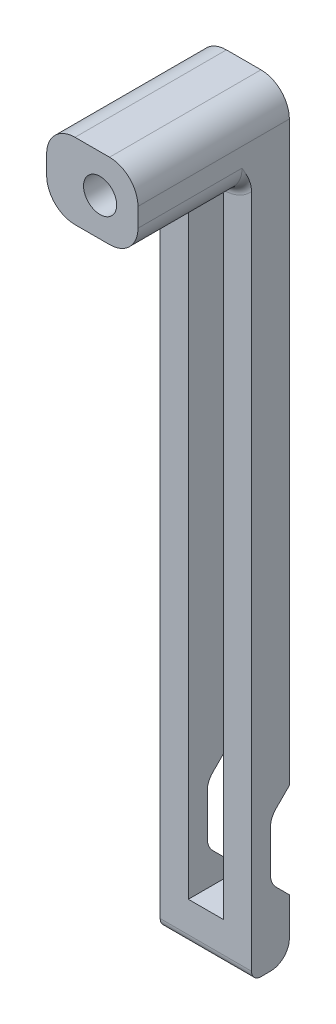
ISO-10303-21;
HEADER;
FILE_DESCRIPTION(('STEP AP214'),'2;1');
FILE_NAME('part.step','',(''),(''),'','','');
FILE_SCHEMA(('AUTOMOTIVE_DESIGN { 1 0 10303 214 1 1 1 1 }'));
ENDSEC;
DATA;
#1=APPLICATION_CONTEXT('core data for automotive mechanical design processes');
#2=APPLICATION_PROTOCOL_DEFINITION('international standard','automotive_design',2000,#1);
#3=PRODUCT_CONTEXT('',#1,'mechanical');
#4=PRODUCT('Part','Part','',(#3));
#5=PRODUCT_RELATED_PRODUCT_CATEGORY('part','',(#4));
#6=PRODUCT_DEFINITION_FORMATION('','',#4);
#7=PRODUCT_DEFINITION_CONTEXT('part definition',#1,'design');
#8=PRODUCT_DEFINITION('design','',#6,#7);
#9=PRODUCT_DEFINITION_SHAPE('','',#8);
#10=(LENGTH_UNIT() NAMED_UNIT(*) SI_UNIT(.MILLI.,.METRE.));
#11=(NAMED_UNIT(*) PLANE_ANGLE_UNIT() SI_UNIT($,.RADIAN.));
#12=(NAMED_UNIT(*) SI_UNIT($,.STERADIAN.) SOLID_ANGLE_UNIT());
#13=UNCERTAINTY_MEASURE_WITH_UNIT(LENGTH_MEASURE(1.E-05),#10,'distance_accuracy_value','');
#14=(GEOMETRIC_REPRESENTATION_CONTEXT(3) GLOBAL_UNCERTAINTY_ASSIGNED_CONTEXT((#13)) GLOBAL_UNIT_ASSIGNED_CONTEXT((#10,
#11,#12)) REPRESENTATION_CONTEXT('',''));
#15=CARTESIAN_POINT('',(0.,0.,0.));
#16=DIRECTION('',(0.,0.,1.));
#17=DIRECTION('',(1.,0.,0.));
#18=AXIS2_PLACEMENT_3D('',#15,#16,#17);
#19=CARTESIAN_POINT('',(0.,0.,2.));
#20=DIRECTION('',(0.,0.,1.));
#21=DIRECTION('',(1.,0.,0.));
#22=AXIS2_PLACEMENT_3D('',#19,#20,#21);
#23=PLANE('',#22);
#24=DIRECTION('',(0.,1.,0.));
#25=VECTOR('',#24,1.);
#26=CARTESIAN_POINT('',(1.85,30.75,2.));
#27=LINE('',#26,#25);
#28=CARTESIAN_POINT('',(1.85000000000001,-35.75,2.));
#29=VERTEX_POINT('',#28);
#30=CARTESIAN_POINT('',(1.85,30.75,2.));
#31=VERTEX_POINT('',#30);
#32=EDGE_CURVE('E508',#29,#31,#27,.T.);
#33=ORIENTED_EDGE('',*,*,#32,.F.);
#34=DIRECTION('',(1.,0.,0.));
#35=VECTOR('',#34,1.);
#36=CARTESIAN_POINT('',(-1.84999999999999,-35.75,2.));
#37=LINE('',#36,#35);
#38=CARTESIAN_POINT('',(-1.84999999999999,-35.75,2.));
#39=VERTEX_POINT('',#38);
#40=EDGE_CURVE('E528',#39,#29,#37,.T.);
#41=ORIENTED_EDGE('',*,*,#40,.F.);
#42=DIRECTION('',(0.,-1.,0.));
#43=VECTOR('',#42,1.);
#44=CARTESIAN_POINT('',(-1.85,30.75,2.));
#45=LINE('',#44,#43);
#46=CARTESIAN_POINT('',(-1.85,30.75,2.));
#47=VERTEX_POINT('',#46);
#48=EDGE_CURVE('E525',#47,#39,#45,.T.);
#49=ORIENTED_EDGE('',*,*,#48,.F.);
#50=DIRECTION('',(-1.,0.,0.));
#51=VECTOR('',#50,1.);
#52=CARTESIAN_POINT('',(-1.85,30.75,2.));
#53=LINE('',#52,#51);
#54=EDGE_CURVE('E522',#31,#47,#53,.T.);
#55=ORIENTED_EDGE('',*,*,#54,.F.);
#56=EDGE_LOOP('',(#33,#41,#49,#55));
#57=FACE_BOUND('',#56,.T.);
#58=DIRECTION('',(1.,0.,0.));
#59=VECTOR('',#58,1.);
#60=CARTESIAN_POINT('',(0.,31.,2.));
#61=LINE('',#60,#59);
#62=CARTESIAN_POINT('',(1.825,31.,2.));
#63=VERTEX_POINT('',#62);
#64=CARTESIAN_POINT('',(-1.825,31.,2.));
#65=VERTEX_POINT('',#64);
#66=EDGE_CURVE('E410',#63,#65,#61,.F.);
#67=ORIENTED_EDGE('',*,*,#66,.T.);
#68=CARTESIAN_POINT('',(-1.825,35.,2.));
#69=DIRECTION('',(0.,0.,1.));
#70=DIRECTION('',(1.,0.,0.));
#71=AXIS2_PLACEMENT_3D('',#68,#69,#70);
#72=CIRCLE('',#71,4.);
#73=CARTESIAN_POINT('',(-4.825,32.3542486889354,2.));
#74=VERTEX_POINT('',#73);
#75=EDGE_CURVE('E414',#65,#74,#72,.F.);
#76=ORIENTED_EDGE('',*,*,#75,.T.);
#77=DIRECTION('',(0.,-1.,0.));
#78=VECTOR('',#77,1.);
#79=CARTESIAN_POINT('',(-4.825,40.,2.));
#80=LINE('',#79,#78);
#81=CARTESIAN_POINT('',(-4.82499999999999,-39.,2.));
#82=VERTEX_POINT('',#81);
#83=EDGE_CURVE('E285',#74,#82,#80,.T.);
#84=ORIENTED_EDGE('',*,*,#83,.T.);
#85=DIRECTION('',(1.,0.,0.));
#86=VECTOR('',#85,1.);
#87=CARTESIAN_POINT('',(4.82500000000001,-39.,2.));
#88=LINE('',#87,#86);
#89=CARTESIAN_POINT('',(4.82500000000001,-39.,2.));
#90=VERTEX_POINT('',#89);
#91=EDGE_CURVE('E343',#82,#90,#88,.T.);
#92=ORIENTED_EDGE('',*,*,#91,.T.);
#93=DIRECTION('',(0.,1.,0.));
#94=VECTOR('',#93,1.);
#95=CARTESIAN_POINT('',(4.825,40.,2.));
#96=LINE('',#95,#94);
#97=CARTESIAN_POINT('',(4.825,32.3542486889354,2.));
#98=VERTEX_POINT('',#97);
#99=EDGE_CURVE('E292',#90,#98,#96,.T.);
#100=ORIENTED_EDGE('',*,*,#99,.T.);
#101=CARTESIAN_POINT('',(1.825,35.,2.));
#102=DIRECTION('',(0.,0.,1.));
#103=DIRECTION('',(1.,0.,0.));
#104=AXIS2_PLACEMENT_3D('',#101,#102,#103);
#105=CIRCLE('',#104,4.);
#106=EDGE_CURVE('E412',#98,#63,#105,.F.);
#107=ORIENTED_EDGE('',*,*,#106,.T.);
#108=EDGE_LOOP('',(#67,#76,#84,#92,#100,#107));
#109=FACE_BOUND('',#108,.T.);
#110=ADVANCED_FACE('F37',(#57,#109),#23,.T.);
#111=CARTESIAN_POINT('',(0.,0.,-2.));
#112=DIRECTION('',(0.,0.,1.));
#113=DIRECTION('',(1.,0.,0.));
#114=AXIS2_PLACEMENT_3D('',#111,#112,#113);
#115=PLANE('',#114);
#116=DIRECTION('',(0.,1.,0.));
#117=VECTOR('',#116,1.);
#118=CARTESIAN_POINT('',(4.825,40.,-2.));
#119=LINE('',#118,#117);
#120=CARTESIAN_POINT('',(4.82500000000001,-38.,-2.));
#121=VERTEX_POINT('',#120);
#122=CARTESIAN_POINT('',(4.82500000000001,-34.,-2.));
#123=VERTEX_POINT('',#122);
#124=EDGE_CURVE('E277',#121,#123,#119,.T.);
#125=ORIENTED_EDGE('',*,*,#124,.F.);
#126=DIRECTION('',(1.,0.,0.));
#127=VECTOR('',#126,1.);
#128=CARTESIAN_POINT('',(0.,-38.,-2.));
#129=LINE('',#128,#127);
#130=CARTESIAN_POINT('',(-4.82499999999999,-38.,-2.));
#131=VERTEX_POINT('',#130);
#132=EDGE_CURVE('E377',#121,#131,#129,.F.);
#133=ORIENTED_EDGE('',*,*,#132,.T.);
#134=DIRECTION('',(0.,-1.,0.));
#135=VECTOR('',#134,1.);
#136=CARTESIAN_POINT('',(-4.825,40.,-2.));
#137=LINE('',#136,#135);
#138=CARTESIAN_POINT('',(-4.82499999999999,-34.4142135623731,-2.));
#139=VERTEX_POINT('',#138);
#140=EDGE_CURVE('E289',#139,#131,#137,.T.);
#141=ORIENTED_EDGE('',*,*,#140,.F.);
#142=DIRECTION('',(1.,0.,0.));
#143=VECTOR('',#142,1.);
#144=CARTESIAN_POINT('',(0.,-34.4142135623731,-2.));
#145=LINE('',#144,#143);
#146=CARTESIAN_POINT('',(-1.84999999999999,-34.4142135623731,-2.));
#147=VERTEX_POINT('',#146);
#148=EDGE_CURVE('E353',#139,#147,#145,.T.);
#149=ORIENTED_EDGE('',*,*,#148,.T.);
#150=DIRECTION('',(0.,-1.,0.));
#151=VECTOR('',#150,1.);
#152=CARTESIAN_POINT('',(-1.85,30.75,-2.));
#153=LINE('',#152,#151);
#154=CARTESIAN_POINT('',(-1.84999999999999,-35.75,-2.));
#155=VERTEX_POINT('',#154);
#156=EDGE_CURVE('E514',#147,#155,#153,.T.);
#157=ORIENTED_EDGE('',*,*,#156,.T.);
#158=DIRECTION('',(1.,0.,0.));
#159=VECTOR('',#158,1.);
#160=CARTESIAN_POINT('',(-1.84999999999999,-35.75,-2.));
#161=LINE('',#160,#159);
#162=CARTESIAN_POINT('',(1.85000000000001,-35.75,-2.));
#163=VERTEX_POINT('',#162);
#164=EDGE_CURVE('E518',#155,#163,#161,.T.);
#165=ORIENTED_EDGE('',*,*,#164,.T.);
#166=DIRECTION('',(0.,1.,0.));
#167=VECTOR('',#166,1.);
#168=CARTESIAN_POINT('',(1.85,30.75,-2.));
#169=LINE('',#168,#167);
#170=CARTESIAN_POINT('',(1.85000000000001,-34.,-2.));
#171=VERTEX_POINT('',#170);
#172=EDGE_CURVE('E494',#163,#171,#169,.T.);
#173=ORIENTED_EDGE('',*,*,#172,.T.);
#174=DIRECTION('',(1.,0.,0.));
#175=VECTOR('',#174,1.);
#176=CARTESIAN_POINT('',(-4.825,-34.,-2.));
#177=LINE('',#176,#175);
#178=EDGE_CURVE('E260',#171,#123,#177,.T.);
#179=ORIENTED_EDGE('',*,*,#178,.T.);
#180=EDGE_LOOP('',(#125,#133,#141,#149,#157,#165,#173,#179));
#181=FACE_BOUND('',#180,.T.);
#182=ADVANCED_FACE('F450',(#181),#115,.F.);
#183=CARTESIAN_POINT('',(4.825,40.,2.));
#184=DIRECTION('',(-1.,0.,0.));
#185=DIRECTION('',(0.,-1.,0.));
#186=AXIS2_PLACEMENT_3D('',#183,#184,#185);
#187=PLANE('',#186);
#188=CARTESIAN_POINT('',(4.82500000000001,-24.,-2.));
#189=VERTEX_POINT('',#188);
#190=CARTESIAN_POINT('',(4.825,37.,-2.));
#191=VERTEX_POINT('',#190);
#192=EDGE_CURVE('E266',#189,#191,#119,.T.);
#193=ORIENTED_EDGE('',*,*,#192,.T.);
#194=DIRECTION('',(0.,0.,-1.));
#195=VECTOR('',#194,1.);
#196=CARTESIAN_POINT('',(4.825,37.,2.));
#197=LINE('',#196,#195);
#198=CARTESIAN_POINT('',(4.825,37.,14.));
#199=VERTEX_POINT('',#198);
#200=EDGE_CURVE('E404',#191,#199,#197,.F.);
#201=ORIENTED_EDGE('',*,*,#200,.T.);
#202=DIRECTION('',(0.,1.,0.));
#203=VECTOR('',#202,1.);
#204=CARTESIAN_POINT('',(4.825,32.,14.));
#205=LINE('',#204,#203);
#206=CARTESIAN_POINT('',(4.825,35.,14.));
#207=VERTEX_POINT('',#206);
#208=EDGE_CURVE('E567',#207,#199,#205,.T.);
#209=ORIENTED_EDGE('',*,*,#208,.F.);
#210=DIRECTION('',(0.,0.,-1.));
#211=VECTOR('',#210,1.);
#212=CARTESIAN_POINT('',(4.825,35.,2.));
#213=LINE('',#212,#211);
#214=CARTESIAN_POINT('',(4.825,35.,3.));
#215=VERTEX_POINT('',#214);
#216=EDGE_CURVE('E402',#207,#215,#213,.T.);
#217=ORIENTED_EDGE('',*,*,#216,.T.);
#218=CARTESIAN_POINT('',(4.825,32.3542486889354,2.));
#219=CARTESIAN_POINT('',(4.825,32.4298380551689,2.00001943055381));
#220=CARTESIAN_POINT('',(4.825,32.5053247598366,2.00374525929694));
#221=CARTESIAN_POINT('',(4.825,32.6555519131941,2.01764872031717));
#222=CARTESIAN_POINT('',(4.825,32.7302936123834,2.0278125407329));
#223=CARTESIAN_POINT('',(4.825,32.9509200380866,2.06617731698388));
#224=CARTESIAN_POINT('',(4.825,33.095419127168,2.10230955711424));
#225=CARTESIAN_POINT('',(4.825,33.3922579658776,2.19397177417643));
#226=CARTESIAN_POINT('',(4.825,33.5441230208571,2.2509618691382));
#227=CARTESIAN_POINT('',(4.825,33.8426105747907,2.37746006612358));
#228=CARTESIAN_POINT('',(4.825,33.9892268347202,2.44698250896105));
#229=CARTESIAN_POINT('',(4.825,34.4249203999017,2.66804637884328));
#230=CARTESIAN_POINT('',(4.825,34.7078523703817,2.83132923919401));
#231=CARTESIAN_POINT('',(4.825,34.993675467035,2.99634854847155));
#232=CARTESIAN_POINT('',(4.825,34.9968377449664,2.99817429080111));
#233=CARTESIAN_POINT('',(4.825,35.,3.));
#234=B_SPLINE_CURVE_WITH_KNOTS('',3,(#218,#219,#220,#221,#222,#223,#224,#225,#226,#227,#228,
#229,#230,#231,#232,#233),.UNSPECIFIED.,.F.,.F.,(4,2,2,2,2,2,2,4),(0.,0.226523097183508,
0.452561857357312,0.898071970071575,1.3839199780656,1.87032751436397,2.84948260162625,
2.86043705277646),.UNSPECIFIED.);
#235=EDGE_CURVE('E11',#215,#98,#234,.F.);
#236=ORIENTED_EDGE('',*,*,#235,.T.);
#237=ORIENTED_EDGE('',*,*,#99,.F.);
#238=CARTESIAN_POINT('',(4.82500000000001,-39.,1.));
#239=DIRECTION('',(-1.,0.,0.));
#240=DIRECTION('',(0.,-1.,0.));
#241=AXIS2_PLACEMENT_3D('',#238,#239,#240);
#242=CIRCLE('',#241,1.);
#243=CARTESIAN_POINT('',(4.82500000000001,-40.,1.));
#244=VERTEX_POINT('',#243);
#245=EDGE_CURVE('E346',#90,#244,#242,.F.);
#246=ORIENTED_EDGE('',*,*,#245,.T.);
#247=DIRECTION('',(0.,0.,-1.));
#248=VECTOR('',#247,1.);
#249=CARTESIAN_POINT('',(4.82500000000001,-40.,2.));
#250=LINE('',#249,#248);
#251=CARTESIAN_POINT('',(4.82500000000001,-40.,0.));
#252=VERTEX_POINT('',#251);
#253=EDGE_CURVE('E293',#244,#252,#250,.T.);
#254=ORIENTED_EDGE('',*,*,#253,.T.);
#255=CARTESIAN_POINT('',(4.82500000000001,-38.,0.));
#256=DIRECTION('',(-1.,0.,0.));
#257=DIRECTION('',(0.,-1.,0.));
#258=AXIS2_PLACEMENT_3D('',#255,#256,#257);
#259=CIRCLE('',#258,2.);
#260=EDGE_CURVE('E375',#252,#121,#259,.F.);
#261=ORIENTED_EDGE('',*,*,#260,.T.);
#262=ORIENTED_EDGE('',*,*,#124,.T.);
#263=DIRECTION('',(0.,-0.70710678118655,-0.707106781186545));
#264=VECTOR('',#263,1.);
#265=CARTESIAN_POINT('',(4.82500000000001,-32.,0.));
#266=LINE('',#265,#264);
#267=CARTESIAN_POINT('',(4.82500000000001,-32.5857864376269,-0.585786437626901));
#268=VERTEX_POINT('',#267);
#269=EDGE_CURVE('E501',#268,#123,#266,.T.);
#270=ORIENTED_EDGE('',*,*,#269,.F.);
#271=CARTESIAN_POINT('',(4.82500000000001,-31.1715728752538,-2.));
#272=DIRECTION('',(-1.,0.,0.));
#273=DIRECTION('',(0.,-1.,0.));
#274=AXIS2_PLACEMENT_3D('',#271,#272,#273);
#275=CIRCLE('',#274,2.);
#276=CARTESIAN_POINT('',(4.82500000000001,-31.1715728752538,0.));
#277=VERTEX_POINT('',#276);
#278=EDGE_CURVE('E339',#268,#277,#275,.T.);
#279=ORIENTED_EDGE('',*,*,#278,.T.);
#280=DIRECTION('',(0.,-1.,0.));
#281=VECTOR('',#280,1.);
#282=CARTESIAN_POINT('',(4.82500000000001,-26.,0.));
#283=LINE('',#282,#281);
#284=CARTESIAN_POINT('',(4.82500000000001,-26.8284271247462,0.));
#285=VERTEX_POINT('',#284);
#286=EDGE_CURVE('E270',#285,#277,#283,.T.);
#287=ORIENTED_EDGE('',*,*,#286,.F.);
#288=CARTESIAN_POINT('',(4.82500000000001,-26.8284271247462,-2.));
#289=DIRECTION('',(-1.,0.,0.));
#290=DIRECTION('',(0.,-1.,0.));
#291=AXIS2_PLACEMENT_3D('',#288,#289,#290);
#292=CIRCLE('',#291,2.);
#293=CARTESIAN_POINT('',(4.82500000000001,-25.4142135623731,-0.585786437626897));
#294=VERTEX_POINT('',#293);
#295=EDGE_CURVE('E269',#285,#294,#292,.T.);
#296=ORIENTED_EDGE('',*,*,#295,.T.);
#297=DIRECTION('',(0.,-0.707106781186551,0.707106781186544));
#298=VECTOR('',#297,1.);
#299=CARTESIAN_POINT('',(4.82500000000001,-24.,-2.));
#300=LINE('',#299,#298);
#301=EDGE_CURVE('E253',#189,#294,#300,.T.);
#302=ORIENTED_EDGE('',*,*,#301,.F.);
#303=EDGE_LOOP('',(#193,#201,#209,#217,#236,#237,#246,#254,#261,#262,#270,#279,#287,#296,#302));
#304=FACE_BOUND('',#303,.T.);
#305=ADVANCED_FACE('F265',(#304),#187,.F.);
#306=CARTESIAN_POINT('',(-4.825,40.,2.));
#307=DIRECTION('',(0.,-1.,0.));
#308=DIRECTION('',(0.,0.,-1.));
#309=AXIS2_PLACEMENT_3D('',#306,#307,#308);
#310=PLANE('',#309);
#311=DIRECTION('',(-1.,0.,0.));
#312=VECTOR('',#311,1.);
#313=CARTESIAN_POINT('',(-4.825,40.,-2.));
#314=LINE('',#313,#312);
#315=CARTESIAN_POINT('',(1.825,40.,-2.));
#316=VERTEX_POINT('',#315);
#317=CARTESIAN_POINT('',(-1.825,40.,-2.));
#318=VERTEX_POINT('',#317);
#319=EDGE_CURVE('E280',#316,#318,#314,.T.);
#320=ORIENTED_EDGE('',*,*,#319,.T.);
#321=DIRECTION('',(0.,0.,-1.));
#322=VECTOR('',#321,1.);
#323=CARTESIAN_POINT('',(-1.825,40.,2.));
#324=LINE('',#323,#322);
#325=CARTESIAN_POINT('',(-1.825,40.,14.));
#326=VERTEX_POINT('',#325);
#327=EDGE_CURVE('E392',#318,#326,#324,.F.);
#328=ORIENTED_EDGE('',*,*,#327,.T.);
#329=DIRECTION('',(-1.,0.,0.));
#330=VECTOR('',#329,1.);
#331=CARTESIAN_POINT('',(-4.825,40.,14.));
#332=LINE('',#331,#330);
#333=CARTESIAN_POINT('',(1.825,40.,14.));
#334=VERTEX_POINT('',#333);
#335=EDGE_CURVE('E271',#334,#326,#332,.T.);
#336=ORIENTED_EDGE('',*,*,#335,.F.);
#337=DIRECTION('',(0.,0.,-1.));
#338=VECTOR('',#337,1.);
#339=CARTESIAN_POINT('',(1.825,40.,2.));
#340=LINE('',#339,#338);
#341=EDGE_CURVE('E389',#334,#316,#340,.T.);
#342=ORIENTED_EDGE('',*,*,#341,.T.);
#343=EDGE_LOOP('',(#320,#328,#336,#342));
#344=FACE_BOUND('',#343,.T.);
#345=ADVANCED_FACE('F473',(#344),#310,.F.);
#346=CARTESIAN_POINT('',(-4.825,40.,2.));
#347=DIRECTION('',(1.,0.,0.));
#348=DIRECTION('',(0.,1.,0.));
#349=AXIS2_PLACEMENT_3D('',#346,#347,#348);
#350=PLANE('',#349);
#351=DIRECTION('',(0.,-1.,0.));
#352=VECTOR('',#351,1.);
#353=CARTESIAN_POINT('',(-4.825,32.,14.));
#354=LINE('',#353,#352);
#355=CARTESIAN_POINT('',(-4.825,37.,14.));
#356=VERTEX_POINT('',#355);
#357=CARTESIAN_POINT('',(-4.825,35.,14.));
#358=VERTEX_POINT('',#357);
#359=EDGE_CURVE('E565',#356,#358,#354,.T.);
#360=ORIENTED_EDGE('',*,*,#359,.F.);
#361=DIRECTION('',(0.,0.,-1.));
#362=VECTOR('',#361,1.);
#363=CARTESIAN_POINT('',(-4.825,37.,2.));
#364=LINE('',#363,#362);
#365=CARTESIAN_POINT('',(-4.825,37.,-2.));
#366=VERTEX_POINT('',#365);
#367=EDGE_CURVE('E383',#356,#366,#364,.T.);
#368=ORIENTED_EDGE('',*,*,#367,.T.);
#369=CARTESIAN_POINT('',(-4.82499999999999,-23.5857864376269,-2.));
#370=VERTEX_POINT('',#369);
#371=EDGE_CURVE('E290',#366,#370,#137,.T.);
#372=ORIENTED_EDGE('',*,*,#371,.T.);
#373=CARTESIAN_POINT('',(-4.82499999999999,-23.5857864376269,-1.));
#374=DIRECTION('',(1.,0.,0.));
#375=DIRECTION('',(0.,1.,0.));
#376=AXIS2_PLACEMENT_3D('',#373,#374,#375);
#377=CIRCLE('',#376,1.);
#378=CARTESIAN_POINT('',(-4.82500000000001,-24.2928932188134,-1.70710678118655));
#379=VERTEX_POINT('',#378);
#380=EDGE_CURVE('E362',#370,#379,#377,.F.);
#381=ORIENTED_EDGE('',*,*,#380,.T.);
#382=DIRECTION('',(0.,-0.707106781186551,0.707106781186544));
#383=VECTOR('',#382,1.);
#384=CARTESIAN_POINT('',(-4.82500000000001,-24.,-2.));
#385=LINE('',#384,#383);
#386=CARTESIAN_POINT('',(-4.82500000000001,-25.4142135623731,-0.585786437626897));
#387=VERTEX_POINT('',#386);
#388=EDGE_CURVE('E576',#379,#387,#385,.T.);
#389=ORIENTED_EDGE('',*,*,#388,.T.);
#390=CARTESIAN_POINT('',(-4.82499999999999,-26.8284271247462,-2.));
#391=DIRECTION('',(1.,0.,0.));
#392=DIRECTION('',(0.,1.,0.));
#393=AXIS2_PLACEMENT_3D('',#390,#391,#392);
#394=CIRCLE('',#393,2.);
#395=CARTESIAN_POINT('',(-4.82500000000001,-26.8284271247462,0.));
#396=VERTEX_POINT('',#395);
#397=EDGE_CURVE('E334',#387,#396,#394,.T.);
#398=ORIENTED_EDGE('',*,*,#397,.T.);
#399=DIRECTION('',(0.,-1.,0.));
#400=VECTOR('',#399,1.);
#401=CARTESIAN_POINT('',(-4.82500000000001,-26.,0.));
#402=LINE('',#401,#400);
#403=CARTESIAN_POINT('',(-4.825,-31.1715728752538,0.));
#404=VERTEX_POINT('',#403);
#405=EDGE_CURVE('E578',#396,#404,#402,.T.);
#406=ORIENTED_EDGE('',*,*,#405,.T.);
#407=CARTESIAN_POINT('',(-4.82499999999999,-31.1715728752538,-2.));
#408=DIRECTION('',(1.,0.,0.));
#409=DIRECTION('',(0.,1.,0.));
#410=AXIS2_PLACEMENT_3D('',#407,#408,#409);
#411=CIRCLE('',#410,2.);
#412=CARTESIAN_POINT('',(-4.825,-32.5857864376269,-0.585786437626901));
#413=VERTEX_POINT('',#412);
#414=EDGE_CURVE('E330',#404,#413,#411,.T.);
#415=ORIENTED_EDGE('',*,*,#414,.T.);
#416=DIRECTION('',(0.,-0.70710678118655,-0.707106781186545));
#417=VECTOR('',#416,1.);
#418=CARTESIAN_POINT('',(-4.825,-32.,0.));
#419=LINE('',#418,#417);
#420=CARTESIAN_POINT('',(-4.825,-33.7071067811866,-1.70710678118655));
#421=VERTEX_POINT('',#420);
#422=EDGE_CURVE('E261',#413,#421,#419,.T.);
#423=ORIENTED_EDGE('',*,*,#422,.T.);
#424=CARTESIAN_POINT('',(-4.82499999999999,-34.4142135623731,-1.));
#425=DIRECTION('',(1.,0.,0.));
#426=DIRECTION('',(0.,1.,0.));
#427=AXIS2_PLACEMENT_3D('',#424,#425,#426);
#428=CIRCLE('',#427,1.);
#429=EDGE_CURVE('E364',#421,#139,#428,.F.);
#430=ORIENTED_EDGE('',*,*,#429,.T.);
#431=ORIENTED_EDGE('',*,*,#140,.T.);
#432=CARTESIAN_POINT('',(-4.82499999999999,-38.,0.));
#433=DIRECTION('',(1.,0.,0.));
#434=DIRECTION('',(0.,1.,0.));
#435=AXIS2_PLACEMENT_3D('',#432,#433,#434);
#436=CIRCLE('',#435,2.);
#437=CARTESIAN_POINT('',(-4.82499999999999,-40.,0.));
#438=VERTEX_POINT('',#437);
#439=EDGE_CURVE('E379',#131,#438,#436,.F.);
#440=ORIENTED_EDGE('',*,*,#439,.T.);
#441=DIRECTION('',(0.,0.,-1.));
#442=VECTOR('',#441,1.);
#443=CARTESIAN_POINT('',(-4.82499999999999,-40.,2.));
#444=LINE('',#443,#442);
#445=CARTESIAN_POINT('',(-4.82499999999999,-40.,1.));
#446=VERTEX_POINT('',#445);
#447=EDGE_CURVE('E296',#446,#438,#444,.T.);
#448=ORIENTED_EDGE('',*,*,#447,.F.);
#449=CARTESIAN_POINT('',(-4.82499999999999,-39.,1.));
#450=DIRECTION('',(1.,0.,0.));
#451=DIRECTION('',(0.,1.,0.));
#452=AXIS2_PLACEMENT_3D('',#449,#450,#451);
#453=CIRCLE('',#452,1.);
#454=EDGE_CURVE('E350',#446,#82,#453,.F.);
#455=ORIENTED_EDGE('',*,*,#454,.T.);
#456=ORIENTED_EDGE('',*,*,#83,.F.);
#457=CARTESIAN_POINT('',(-4.825,32.3542486889354,2.));
#458=CARTESIAN_POINT('',(-4.825,32.4298380551689,2.00001943055381));
#459=CARTESIAN_POINT('',(-4.825,32.5053247598366,2.00374525929694));
#460=CARTESIAN_POINT('',(-4.825,32.6555519131941,2.01764872031717));
#461=CARTESIAN_POINT('',(-4.825,32.7302936123833,2.0278125407329));
#462=CARTESIAN_POINT('',(-4.825,32.9509200380866,2.06617731698387));
#463=CARTESIAN_POINT('',(-4.825,33.0954191271679,2.10230955711424));
#464=CARTESIAN_POINT('',(-4.825,33.3922579658776,2.19397177417643));
#465=CARTESIAN_POINT('',(-4.825,33.5441230208571,2.25096186913819));
#466=CARTESIAN_POINT('',(-4.825,33.8426105747907,2.3774600661236));
#467=CARTESIAN_POINT('',(-4.825,33.9892268347202,2.44698250896111));
#468=CARTESIAN_POINT('',(-4.825,34.4249203999018,2.66804637884322));
#469=CARTESIAN_POINT('',(-4.825,34.7078523703819,2.8313292391936));
#470=CARTESIAN_POINT('',(-4.825,34.993675467035,2.99634854847155));
#471=CARTESIAN_POINT('',(-4.825,34.9968377449664,2.99817429080111));
#472=CARTESIAN_POINT('',(-4.825,35.,3.));
#473=B_SPLINE_CURVE_WITH_KNOTS('',3,(#457,#458,#459,#460,#461,#462,#463,#464,#465,#466,#467,
#468,#469,#470,#471,#472),.UNSPECIFIED.,.F.,.F.,(4,2,2,2,2,2,2,4),(0.,0.226523097183481,
0.452561857357263,0.898071970071582,1.38391997806561,1.87032751436402,2.84948260162628,
2.86043705277646),.UNSPECIFIED.);
#474=CARTESIAN_POINT('',(-4.825,35.,3.));
#475=VERTEX_POINT('',#474);
#476=EDGE_CURVE('E47',#74,#475,#473,.T.);
#477=ORIENTED_EDGE('',*,*,#476,.T.);
#478=DIRECTION('',(0.,0.,-1.));
#479=VECTOR('',#478,1.);
#480=CARTESIAN_POINT('',(-4.825,35.,2.));
#481=LINE('',#480,#479);
#482=EDGE_CURVE('E381',#475,#358,#481,.F.);
#483=ORIENTED_EDGE('',*,*,#482,.T.);
#484=EDGE_LOOP('',(#360,#368,#372,#381,#389,#398,#406,#415,#423,#430,#431,#440,#448,#455,#456,
#477,#483));
#485=FACE_BOUND('',#484,.T.);
#486=ADVANCED_FACE('F430',(#485),#350,.F.);
#487=CARTESIAN_POINT('',(-4.82499999999999,-40.,2.));
#488=DIRECTION('',(0.,1.,0.));
#489=DIRECTION('',(0.,0.,1.));
#490=AXIS2_PLACEMENT_3D('',#487,#488,#489);
#491=PLANE('',#490);
#492=ORIENTED_EDGE('',*,*,#447,.T.);
#493=DIRECTION('',(1.,0.,0.));
#494=VECTOR('',#493,1.);
#495=CARTESIAN_POINT('',(-4.82499999999999,-40.,0.));
#496=LINE('',#495,#494);
#497=EDGE_CURVE('E372',#438,#252,#496,.T.);
#498=ORIENTED_EDGE('',*,*,#497,.T.);
#499=ORIENTED_EDGE('',*,*,#253,.F.);
#500=DIRECTION('',(1.,0.,0.));
#501=VECTOR('',#500,1.);
#502=CARTESIAN_POINT('',(-4.82499999999999,-40.,1.));
#503=LINE('',#502,#501);
#504=EDGE_CURVE('E348',#244,#446,#503,.F.);
#505=ORIENTED_EDGE('',*,*,#504,.T.);
#506=EDGE_LOOP('',(#492,#498,#499,#505));
#507=FACE_BOUND('',#506,.T.);
#508=ADVANCED_FACE('F465',(#507),#491,.F.);
#509=CARTESIAN_POINT('',(0.824999999999997,36.,-2.));
#510=DIRECTION('',(0.,0.,1.));
#511=DIRECTION('',(1.,0.,0.));
#512=AXIS2_PLACEMENT_3D('',#509,#510,#511);
#513=CIRCLE('',#512,1.75);
#514=CARTESIAN_POINT('',(2.575,36.,-2.));
#515=VERTEX_POINT('',#514);
#516=EDGE_CURVE('E571',#515,#515,#513,.T.);
#517=ORIENTED_EDGE('',*,*,#516,.T.);
#518=EDGE_LOOP('',(#517));
#519=FACE_BOUND('',#518,.T.);
#520=ORIENTED_EDGE('',*,*,#371,.F.);
#521=CARTESIAN_POINT('',(-1.825,37.,-2.));
#522=DIRECTION('',(0.,0.,1.));
#523=DIRECTION('',(1.,0.,0.));
#524=AXIS2_PLACEMENT_3D('',#521,#522,#523);
#525=CIRCLE('',#524,3.);
#526=EDGE_CURVE('E387',#366,#318,#525,.F.);
#527=ORIENTED_EDGE('',*,*,#526,.T.);
#528=ORIENTED_EDGE('',*,*,#319,.F.);
#529=CARTESIAN_POINT('',(1.825,37.,-2.));
#530=DIRECTION('',(0.,0.,1.));
#531=DIRECTION('',(1.,0.,0.));
#532=AXIS2_PLACEMENT_3D('',#529,#530,#531);
#533=CIRCLE('',#532,3.);
#534=EDGE_CURVE('E276',#316,#191,#533,.F.);
#535=ORIENTED_EDGE('',*,*,#534,.T.);
#536=ORIENTED_EDGE('',*,*,#192,.F.);
#537=DIRECTION('',(1.,0.,0.));
#538=VECTOR('',#537,1.);
#539=CARTESIAN_POINT('',(-4.82500000000001,-24.,-2.));
#540=LINE('',#539,#538);
#541=CARTESIAN_POINT('',(1.85000000000001,-24.,-2.));
#542=VERTEX_POINT('',#541);
#543=EDGE_CURVE('E250',#542,#189,#540,.T.);
#544=ORIENTED_EDGE('',*,*,#543,.F.);
#545=CARTESIAN_POINT('',(1.85,30.75,-2.));
#546=VERTEX_POINT('',#545);
#547=EDGE_CURVE('E511',#542,#546,#169,.T.);
#548=ORIENTED_EDGE('',*,*,#547,.T.);
#549=DIRECTION('',(-1.,0.,0.));
#550=VECTOR('',#549,1.);
#551=CARTESIAN_POINT('',(-1.85,30.75,-2.));
#552=LINE('',#551,#550);
#553=CARTESIAN_POINT('',(-1.85,30.75,-2.));
#554=VERTEX_POINT('',#553);
#555=EDGE_CURVE('E510',#546,#554,#552,.T.);
#556=ORIENTED_EDGE('',*,*,#555,.T.);
#557=CARTESIAN_POINT('',(-1.84999999999999,-23.5857864376269,-2.));
#558=VERTEX_POINT('',#557);
#559=EDGE_CURVE('E515',#554,#558,#153,.T.);
#560=ORIENTED_EDGE('',*,*,#559,.T.);
#561=DIRECTION('',(1.,0.,0.));
#562=VECTOR('',#561,1.);
#563=CARTESIAN_POINT('',(0.,-23.5857864376269,-2.));
#564=LINE('',#563,#562);
#565=EDGE_CURVE('E369',#558,#370,#564,.F.);
#566=ORIENTED_EDGE('',*,*,#565,.T.);
#567=EDGE_LOOP('',(#520,#527,#528,#535,#536,#544,#548,#556,#560,#566));
#568=FACE_BOUND('',#567,.T.);
#569=ADVANCED_FACE('F274',(#519,#568),#115,.F.);
#570=CARTESIAN_POINT('',(1.85,30.75,-2.));
#571=DIRECTION('',(1.,0.,0.));
#572=DIRECTION('',(0.,1.,0.));
#573=AXIS2_PLACEMENT_3D('',#570,#571,#572);
#574=PLANE('',#573);
#575=DIRECTION('',(0.,-0.707106781186551,0.707106781186544));
#576=VECTOR('',#575,1.);
#577=CARTESIAN_POINT('',(1.85,3.3750000000003,-29.375));
#578=LINE('',#577,#576);
#579=CARTESIAN_POINT('',(1.85000000000001,-25.4142135623731,-0.585786437626887));
#580=VERTEX_POINT('',#579);
#581=EDGE_CURVE('E256',#542,#580,#578,.T.);
#582=ORIENTED_EDGE('',*,*,#581,.T.);
#583=CARTESIAN_POINT('',(1.85000000000001,-26.8284271247462,-2.));
#584=DIRECTION('',(1.,0.,0.));
#585=DIRECTION('',(0.,1.,0.));
#586=AXIS2_PLACEMENT_3D('',#583,#584,#585);
#587=CIRCLE('',#586,2.);
#588=CARTESIAN_POINT('',(1.85000000000001,-26.8284271247462,0.));
#589=VERTEX_POINT('',#588);
#590=EDGE_CURVE('E337',#580,#589,#587,.T.);
#591=ORIENTED_EDGE('',*,*,#590,.T.);
#592=DIRECTION('',(0.,-1.,0.));
#593=VECTOR('',#592,1.);
#594=CARTESIAN_POINT('',(1.85,30.75,0.));
#595=LINE('',#594,#593);
#596=CARTESIAN_POINT('',(1.85000000000001,-31.1715728752538,0.));
#597=VERTEX_POINT('',#596);
#598=EDGE_CURVE('E498',#589,#597,#595,.T.);
#599=ORIENTED_EDGE('',*,*,#598,.T.);
#600=CARTESIAN_POINT('',(1.85000000000001,-31.1715728752538,-2.));
#601=DIRECTION('',(1.,0.,0.));
#602=DIRECTION('',(0.,1.,0.));
#603=AXIS2_PLACEMENT_3D('',#600,#601,#602);
#604=CIRCLE('',#603,2.);
#605=CARTESIAN_POINT('',(1.85000000000001,-32.5857864376269,-0.585786437626908));
#606=VERTEX_POINT('',#605);
#607=EDGE_CURVE('E341',#597,#606,#604,.T.);
#608=ORIENTED_EDGE('',*,*,#607,.T.);
#609=DIRECTION('',(0.,-0.70710678118655,-0.707106781186545));
#610=VECTOR('',#609,1.);
#611=CARTESIAN_POINT('',(1.85,-1.62499999999974,30.375));
#612=LINE('',#611,#610);
#613=EDGE_CURVE('E506',#606,#171,#612,.T.);
#614=ORIENTED_EDGE('',*,*,#613,.T.);
#615=ORIENTED_EDGE('',*,*,#172,.F.);
#616=DIRECTION('',(0.,0.,1.));
#617=VECTOR('',#616,1.);
#618=CARTESIAN_POINT('',(1.85000000000001,-35.75,-2.));
#619=LINE('',#618,#617);
#620=EDGE_CURVE('E278',#163,#29,#619,.T.);
#621=ORIENTED_EDGE('',*,*,#620,.T.);
#622=ORIENTED_EDGE('',*,*,#32,.T.);
#623=DIRECTION('',(0.,0.,1.));
#624=VECTOR('',#623,1.);
#625=CARTESIAN_POINT('',(1.85,30.75,-2.));
#626=LINE('',#625,#624);
#627=EDGE_CURVE('E520',#546,#31,#626,.T.);
#628=ORIENTED_EDGE('',*,*,#627,.F.);
#629=ORIENTED_EDGE('',*,*,#547,.F.);
#630=EDGE_LOOP('',(#582,#591,#599,#608,#614,#615,#621,#622,#628,#629));
#631=FACE_BOUND('',#630,.T.);
#632=ADVANCED_FACE('F462',(#631),#574,.F.);
#633=CARTESIAN_POINT('',(-1.84999999999999,-35.75,-2.));
#634=DIRECTION('',(0.,-1.,0.));
#635=DIRECTION('',(1.,0.,0.));
#636=AXIS2_PLACEMENT_3D('',#633,#634,#635);
#637=PLANE('',#636);
#638=ORIENTED_EDGE('',*,*,#40,.T.);
#639=ORIENTED_EDGE('',*,*,#620,.F.);
#640=ORIENTED_EDGE('',*,*,#164,.F.);
#641=DIRECTION('',(0.,0.,1.));
#642=VECTOR('',#641,1.);
#643=CARTESIAN_POINT('',(-1.84999999999999,-35.75,-2.));
#644=LINE('',#643,#642);
#645=EDGE_CURVE('E281',#155,#39,#644,.T.);
#646=ORIENTED_EDGE('',*,*,#645,.T.);
#647=EDGE_LOOP('',(#638,#639,#640,#646));
#648=FACE_BOUND('',#647,.T.);
#649=ADVANCED_FACE('F679',(#648),#637,.F.);
#650=CARTESIAN_POINT('',(-1.85,30.75,-2.));
#651=DIRECTION('',(-1.,0.,0.));
#652=DIRECTION('',(0.,-1.,0.));
#653=AXIS2_PLACEMENT_3D('',#650,#651,#652);
#654=PLANE('',#653);
#655=ORIENTED_EDGE('',*,*,#156,.F.);
#656=CARTESIAN_POINT('',(-1.84999999999999,-34.4142135623731,-1.));
#657=DIRECTION('',(-1.,0.,0.));
#658=DIRECTION('',(0.,-1.,0.));
#659=AXIS2_PLACEMENT_3D('',#656,#657,#658);
#660=CIRCLE('',#659,1.);
#661=CARTESIAN_POINT('',(-1.84999999999999,-33.7071067811866,-1.70710678118655));
#662=VERTEX_POINT('',#661);
#663=EDGE_CURVE('E358',#147,#662,#660,.F.);
#664=ORIENTED_EDGE('',*,*,#663,.T.);
#665=DIRECTION('',(0.,0.70710678118655,0.707106781186545));
#666=VECTOR('',#665,1.);
#667=CARTESIAN_POINT('',(-1.85,-1.62499999999974,30.375));
#668=LINE('',#667,#666);
#669=CARTESIAN_POINT('',(-1.84999999999999,-32.5857864376269,-0.585786437626908));
#670=VERTEX_POINT('',#669);
#671=EDGE_CURVE('E305',#662,#670,#668,.T.);
#672=ORIENTED_EDGE('',*,*,#671,.T.);
#673=CARTESIAN_POINT('',(-1.84999999999999,-31.1715728752538,-2.));
#674=DIRECTION('',(-1.,0.,0.));
#675=DIRECTION('',(0.,-1.,0.));
#676=AXIS2_PLACEMENT_3D('',#673,#674,#675);
#677=CIRCLE('',#676,2.);
#678=CARTESIAN_POINT('',(-1.84999999999999,-31.1715728752538,0.));
#679=VERTEX_POINT('',#678);
#680=EDGE_CURVE('E328',#670,#679,#677,.T.);
#681=ORIENTED_EDGE('',*,*,#680,.T.);
#682=DIRECTION('',(0.,1.,0.));
#683=VECTOR('',#682,1.);
#684=CARTESIAN_POINT('',(-1.85,30.75,0.));
#685=LINE('',#684,#683);
#686=CARTESIAN_POINT('',(-1.84999999999999,-26.8284271247462,0.));
#687=VERTEX_POINT('',#686);
#688=EDGE_CURVE('E302',#679,#687,#685,.T.);
#689=ORIENTED_EDGE('',*,*,#688,.T.);
#690=CARTESIAN_POINT('',(-1.84999999999999,-26.8284271247462,-2.));
#691=DIRECTION('',(-1.,0.,0.));
#692=DIRECTION('',(0.,-1.,0.));
#693=AXIS2_PLACEMENT_3D('',#690,#691,#692);
#694=CIRCLE('',#693,2.);
#695=CARTESIAN_POINT('',(-1.84999999999999,-25.4142135623731,-0.585786437626887));
#696=VERTEX_POINT('',#695);
#697=EDGE_CURVE('E332',#687,#696,#694,.T.);
#698=ORIENTED_EDGE('',*,*,#697,.T.);
#699=DIRECTION('',(0.,0.707106781186551,-0.707106781186544));
#700=VECTOR('',#699,1.);
#701=CARTESIAN_POINT('',(-1.85,3.3750000000003,-29.375));
#702=LINE('',#701,#700);
#703=CARTESIAN_POINT('',(-1.84999999999999,-24.2928932188134,-1.70710678118654));
#704=VERTEX_POINT('',#703);
#705=EDGE_CURVE('E299',#696,#704,#702,.T.);
#706=ORIENTED_EDGE('',*,*,#705,.T.);
#707=CARTESIAN_POINT('',(-1.84999999999999,-23.5857864376269,-1.));
#708=DIRECTION('',(-1.,0.,0.));
#709=DIRECTION('',(0.,-1.,0.));
#710=AXIS2_PLACEMENT_3D('',#707,#708,#709);
#711=CIRCLE('',#710,1.);
#712=EDGE_CURVE('E356',#704,#558,#711,.F.);
#713=ORIENTED_EDGE('',*,*,#712,.T.);
#714=ORIENTED_EDGE('',*,*,#559,.F.);
#715=DIRECTION('',(0.,0.,1.));
#716=VECTOR('',#715,1.);
#717=CARTESIAN_POINT('',(-1.85,30.75,-2.));
#718=LINE('',#717,#716);
#719=EDGE_CURVE('E532',#554,#47,#718,.T.);
#720=ORIENTED_EDGE('',*,*,#719,.T.);
#721=ORIENTED_EDGE('',*,*,#48,.T.);
#722=ORIENTED_EDGE('',*,*,#645,.F.);
#723=EDGE_LOOP('',(#655,#664,#672,#681,#689,#698,#706,#713,#714,#720,#721,#722));
#724=FACE_BOUND('',#723,.T.);
#725=ADVANCED_FACE('F674',(#724),#654,.F.);
#726=CARTESIAN_POINT('',(-1.85,30.75,-2.));
#727=DIRECTION('',(0.,1.,0.));
#728=DIRECTION('',(0.,0.,1.));
#729=AXIS2_PLACEMENT_3D('',#726,#727,#728);
#730=PLANE('',#729);
#731=ORIENTED_EDGE('',*,*,#54,.T.);
#732=ORIENTED_EDGE('',*,*,#719,.F.);
#733=ORIENTED_EDGE('',*,*,#555,.F.);
#734=ORIENTED_EDGE('',*,*,#627,.T.);
#735=EDGE_LOOP('',(#731,#732,#733,#734));
#736=FACE_BOUND('',#735,.T.);
#737=ADVANCED_FACE('F684',(#736),#730,.F.);
#738=CARTESIAN_POINT('',(-4.82500000000001,-24.,-2.));
#739=DIRECTION('',(0.,0.707106781186544,0.707106781186551));
#740=DIRECTION('',(0.,-0.707106781186551,0.707106781186544));
#741=AXIS2_PLACEMENT_3D('',#738,#739,#740);
#742=PLANE('',#741);
#743=ORIENTED_EDGE('',*,*,#388,.F.);
#744=DIRECTION('',(1.,0.,0.));
#745=VECTOR('',#744,1.);
#746=CARTESIAN_POINT('',(-4.82500000000001,-24.2928932188134,-1.70710678118655));
#747=LINE('',#746,#745);
#748=EDGE_CURVE('E366',#379,#704,#747,.T.);
#749=ORIENTED_EDGE('',*,*,#748,.T.);
#750=ORIENTED_EDGE('',*,*,#705,.F.);
#751=DIRECTION('',(1.,0.,0.));
#752=VECTOR('',#751,1.);
#753=CARTESIAN_POINT('',(-4.82500000000001,-25.4142135623731,-0.585786437626897));
#754=LINE('',#753,#752);
#755=EDGE_CURVE('E315',#696,#387,#754,.F.);
#756=ORIENTED_EDGE('',*,*,#755,.T.);
#757=EDGE_LOOP('',(#743,#749,#750,#756));
#758=FACE_BOUND('',#757,.T.);
#759=ADVANCED_FACE('F650',(#758),#742,.F.);
#760=CARTESIAN_POINT('',(-4.82500000000001,-26.,0.));
#761=DIRECTION('',(0.,0.,1.));
#762=DIRECTION('',(0.,-1.,0.));
#763=AXIS2_PLACEMENT_3D('',#760,#761,#762);
#764=PLANE('',#763);
#765=ORIENTED_EDGE('',*,*,#688,.F.);
#766=DIRECTION('',(1.,0.,0.));
#767=VECTOR('',#766,1.);
#768=CARTESIAN_POINT('',(-4.825,-31.1715728752538,0.));
#769=LINE('',#768,#767);
#770=EDGE_CURVE('E313',#679,#404,#769,.F.);
#771=ORIENTED_EDGE('',*,*,#770,.T.);
#772=ORIENTED_EDGE('',*,*,#405,.F.);
#773=DIRECTION('',(1.,0.,0.));
#774=VECTOR('',#773,1.);
#775=CARTESIAN_POINT('',(-1.84999999999999,-26.8284271247462,0.));
#776=LINE('',#775,#774);
#777=EDGE_CURVE('E310',#396,#687,#776,.T.);
#778=ORIENTED_EDGE('',*,*,#777,.T.);
#779=EDGE_LOOP('',(#765,#771,#772,#778));
#780=FACE_BOUND('',#779,.T.);
#781=ADVANCED_FACE('F659',(#780),#764,.F.);
#782=CARTESIAN_POINT('',(-4.825,-32.,0.));
#783=DIRECTION('',(0.,-0.707106781186545,0.70710678118655));
#784=DIRECTION('',(0.,-0.70710678118655,-0.707106781186545));
#785=AXIS2_PLACEMENT_3D('',#782,#783,#784);
#786=PLANE('',#785);
#787=ORIENTED_EDGE('',*,*,#671,.F.);
#788=DIRECTION('',(1.,0.,0.));
#789=VECTOR('',#788,1.);
#790=CARTESIAN_POINT('',(-4.825,-33.7071067811866,-1.70710678118655));
#791=LINE('',#790,#789);
#792=EDGE_CURVE('E360',#662,#421,#791,.F.);
#793=ORIENTED_EDGE('',*,*,#792,.T.);
#794=ORIENTED_EDGE('',*,*,#422,.F.);
#795=DIRECTION('',(1.,0.,0.));
#796=VECTOR('',#795,1.);
#797=CARTESIAN_POINT('',(-1.84999999999999,-32.5857864376269,-0.585786437626901));
#798=LINE('',#797,#796);
#799=EDGE_CURVE('E307',#413,#670,#798,.T.);
#800=ORIENTED_EDGE('',*,*,#799,.T.);
#801=EDGE_LOOP('',(#787,#793,#794,#800));
#802=FACE_BOUND('',#801,.T.);
#803=ADVANCED_FACE('F668',(#802),#786,.F.);
#804=ORIENTED_EDGE('',*,*,#613,.F.);
#805=DIRECTION('',(1.,0.,0.));
#806=VECTOR('',#805,1.);
#807=CARTESIAN_POINT('',(4.82500000000001,-32.5857864376269,-0.585786437626902));
#808=LINE('',#807,#806);
#809=EDGE_CURVE('E325',#606,#268,#808,.T.);
#810=ORIENTED_EDGE('',*,*,#809,.T.);
#811=ORIENTED_EDGE('',*,*,#269,.T.);
#812=ORIENTED_EDGE('',*,*,#178,.F.);
#813=EDGE_LOOP('',(#804,#810,#811,#812));
#814=FACE_BOUND('',#813,.T.);
#815=ADVANCED_FACE('F585',(#814),#786,.F.);
#816=ORIENTED_EDGE('',*,*,#598,.F.);
#817=DIRECTION('',(1.,0.,0.));
#818=VECTOR('',#817,1.);
#819=CARTESIAN_POINT('',(4.82500000000001,-26.8284271247462,0.));
#820=LINE('',#819,#818);
#821=EDGE_CURVE('E320',#589,#285,#820,.T.);
#822=ORIENTED_EDGE('',*,*,#821,.T.);
#823=ORIENTED_EDGE('',*,*,#286,.T.);
#824=DIRECTION('',(1.,0.,0.));
#825=VECTOR('',#824,1.);
#826=CARTESIAN_POINT('',(1.85000000000001,-31.1715728752538,0.));
#827=LINE('',#826,#825);
#828=EDGE_CURVE('E318',#277,#597,#827,.F.);
#829=ORIENTED_EDGE('',*,*,#828,.T.);
#830=EDGE_LOOP('',(#816,#822,#823,#829));
#831=FACE_BOUND('',#830,.T.);
#832=ADVANCED_FACE('F591',(#831),#764,.F.);
#833=ORIENTED_EDGE('',*,*,#301,.T.);
#834=DIRECTION('',(1.,0.,0.));
#835=VECTOR('',#834,1.);
#836=CARTESIAN_POINT('',(1.85000000000001,-25.4142135623731,-0.585786437626897));
#837=LINE('',#836,#835);
#838=EDGE_CURVE('E323',#294,#580,#837,.F.);
#839=ORIENTED_EDGE('',*,*,#838,.T.);
#840=ORIENTED_EDGE('',*,*,#581,.F.);
#841=ORIENTED_EDGE('',*,*,#543,.T.);
#842=EDGE_LOOP('',(#833,#839,#840,#841));
#843=FACE_BOUND('',#842,.T.);
#844=ADVANCED_FACE('F252',(#843),#742,.F.);
#845=CARTESIAN_POINT('',(-4.825,-31.1715728752538,-2.));
#846=DIRECTION('',(-1.,0.,0.));
#847=DIRECTION('',(0.,-1.,0.));
#848=AXIS2_PLACEMENT_3D('',#845,#846,#847);
#849=CYLINDRICAL_SURFACE('',#848,2.);
#850=ORIENTED_EDGE('',*,*,#414,.F.);
#851=ORIENTED_EDGE('',*,*,#770,.F.);
#852=ORIENTED_EDGE('',*,*,#680,.F.);
#853=ORIENTED_EDGE('',*,*,#799,.F.);
#854=EDGE_LOOP('',(#850,#851,#852,#853));
#855=FACE_BOUND('',#854,.T.);
#856=ADVANCED_FACE('F605',(#855),#849,.F.);
#857=CARTESIAN_POINT('',(-4.82500000000001,-26.8284271247462,-2.));
#858=DIRECTION('',(-1.,0.,0.));
#859=DIRECTION('',(0.,-1.,0.));
#860=AXIS2_PLACEMENT_3D('',#857,#858,#859);
#861=CYLINDRICAL_SURFACE('',#860,2.);
#862=ORIENTED_EDGE('',*,*,#397,.F.);
#863=ORIENTED_EDGE('',*,*,#755,.F.);
#864=ORIENTED_EDGE('',*,*,#697,.F.);
#865=ORIENTED_EDGE('',*,*,#777,.F.);
#866=EDGE_LOOP('',(#862,#863,#864,#865));
#867=FACE_BOUND('',#866,.T.);
#868=ADVANCED_FACE('F598',(#867),#861,.F.);
#869=CARTESIAN_POINT('',(-4.82500000000001,-26.8284271247462,-2.));
#870=DIRECTION('',(-1.,0.,0.));
#871=DIRECTION('',(0.,-1.,0.));
#872=AXIS2_PLACEMENT_3D('',#869,#870,#871);
#873=CYLINDRICAL_SURFACE('',#872,2.);
#874=ORIENTED_EDGE('',*,*,#590,.F.);
#875=ORIENTED_EDGE('',*,*,#838,.F.);
#876=ORIENTED_EDGE('',*,*,#295,.F.);
#877=ORIENTED_EDGE('',*,*,#821,.F.);
#878=EDGE_LOOP('',(#874,#875,#876,#877));
#879=FACE_BOUND('',#878,.T.);
#880=ADVANCED_FACE('F596',(#879),#873,.F.);
#881=CARTESIAN_POINT('',(-4.825,-31.1715728752538,-2.));
#882=DIRECTION('',(-1.,0.,0.));
#883=DIRECTION('',(0.,-1.,0.));
#884=AXIS2_PLACEMENT_3D('',#881,#882,#883);
#885=CYLINDRICAL_SURFACE('',#884,2.);
#886=ORIENTED_EDGE('',*,*,#607,.F.);
#887=ORIENTED_EDGE('',*,*,#828,.F.);
#888=ORIENTED_EDGE('',*,*,#278,.F.);
#889=ORIENTED_EDGE('',*,*,#809,.F.);
#890=EDGE_LOOP('',(#886,#887,#888,#889));
#891=FACE_BOUND('',#890,.T.);
#892=ADVANCED_FACE('F589',(#891),#885,.F.);
#893=CARTESIAN_POINT('',(0.,-39.,1.));
#894=DIRECTION('',(-1.,0.,0.));
#895=DIRECTION('',(0.,0.,1.));
#896=AXIS2_PLACEMENT_3D('',#893,#894,#895);
#897=CYLINDRICAL_SURFACE('',#896,1.);
#898=ORIENTED_EDGE('',*,*,#454,.F.);
#899=ORIENTED_EDGE('',*,*,#504,.F.);
#900=ORIENTED_EDGE('',*,*,#245,.F.);
#901=ORIENTED_EDGE('',*,*,#91,.F.);
#902=EDGE_LOOP('',(#898,#899,#900,#901));
#903=FACE_BOUND('',#902,.T.);
#904=ADVANCED_FACE('F543',(#903),#897,.T.);
#905=CARTESIAN_POINT('',(0.,-34.4142135623731,-1.));
#906=DIRECTION('',(1.,0.,0.));
#907=DIRECTION('',(0.,1.,0.));
#908=AXIS2_PLACEMENT_3D('',#905,#906,#907);
#909=CYLINDRICAL_SURFACE('',#908,1.);
#910=ORIENTED_EDGE('',*,*,#429,.F.);
#911=ORIENTED_EDGE('',*,*,#792,.F.);
#912=ORIENTED_EDGE('',*,*,#663,.F.);
#913=ORIENTED_EDGE('',*,*,#148,.F.);
#914=EDGE_LOOP('',(#910,#911,#912,#913));
#915=FACE_BOUND('',#914,.T.);
#916=ADVANCED_FACE('F612',(#915),#909,.T.);
#917=CARTESIAN_POINT('',(-4.82500000000001,-23.5857864376269,-1.));
#918=DIRECTION('',(1.,0.,0.));
#919=DIRECTION('',(0.,1.,0.));
#920=AXIS2_PLACEMENT_3D('',#917,#918,#919);
#921=CYLINDRICAL_SURFACE('',#920,1.);
#922=ORIENTED_EDGE('',*,*,#380,.F.);
#923=ORIENTED_EDGE('',*,*,#565,.F.);
#924=ORIENTED_EDGE('',*,*,#712,.F.);
#925=ORIENTED_EDGE('',*,*,#748,.F.);
#926=EDGE_LOOP('',(#922,#923,#924,#925));
#927=FACE_BOUND('',#926,.T.);
#928=ADVANCED_FACE('F615',(#927),#921,.T.);
#929=CARTESIAN_POINT('',(-4.825,32.,14.));
#930=DIRECTION('',(0.,1.,0.));
#931=DIRECTION('',(0.,0.,1.));
#932=AXIS2_PLACEMENT_3D('',#929,#930,#931);
#933=PLANE('',#932);
#934=DIRECTION('',(0.,0.,-1.));
#935=VECTOR('',#934,1.);
#936=CARTESIAN_POINT('',(-1.825,32.,14.));
#937=LINE('',#936,#935);
#938=CARTESIAN_POINT('',(-1.825,32.,14.));
#939=VERTEX_POINT('',#938);
#940=CARTESIAN_POINT('',(-1.825,32.,3.));
#941=VERTEX_POINT('',#940);
#942=EDGE_CURVE('E408',#939,#941,#937,.T.);
#943=ORIENTED_EDGE('',*,*,#942,.T.);
#944=DIRECTION('',(1.,0.,0.));
#945=VECTOR('',#944,1.);
#946=CARTESIAN_POINT('',(-4.825,32.,3.));
#947=LINE('',#946,#945);
#948=CARTESIAN_POINT('',(1.825,32.,3.));
#949=VERTEX_POINT('',#948);
#950=EDGE_CURVE('E63',#941,#949,#947,.T.);
#951=ORIENTED_EDGE('',*,*,#950,.T.);
#952=DIRECTION('',(0.,0.,-1.));
#953=VECTOR('',#952,1.);
#954=CARTESIAN_POINT('',(1.825,32.,14.));
#955=LINE('',#954,#953);
#956=CARTESIAN_POINT('',(1.825,32.,14.));
#957=VERTEX_POINT('',#956);
#958=EDGE_CURVE('E406',#949,#957,#955,.F.);
#959=ORIENTED_EDGE('',*,*,#958,.T.);
#960=DIRECTION('',(1.,0.,0.));
#961=VECTOR('',#960,1.);
#962=CARTESIAN_POINT('',(-4.825,32.,14.));
#963=LINE('',#962,#961);
#964=EDGE_CURVE('E563',#939,#957,#963,.T.);
#965=ORIENTED_EDGE('',*,*,#964,.F.);
#966=EDGE_LOOP('',(#943,#951,#959,#965));
#967=FACE_BOUND('',#966,.T.);
#968=ADVANCED_FACE('F566',(#967),#933,.F.);
#969=CARTESIAN_POINT('',(0.,0.,14.));
#970=DIRECTION('',(0.,0.,-1.));
#971=DIRECTION('',(-1.,0.,0.));
#972=AXIS2_PLACEMENT_3D('',#969,#970,#971);
#973=PLANE('',#972);
#974=CARTESIAN_POINT('',(0.824999999999997,36.,14.));
#975=DIRECTION('',(0.,0.,1.));
#976=DIRECTION('',(1.,0.,0.));
#977=AXIS2_PLACEMENT_3D('',#974,#975,#976);
#978=CIRCLE('',#977,1.75);
#979=CARTESIAN_POINT('',(2.575,36.,14.));
#980=VERTEX_POINT('',#979);
#981=EDGE_CURVE('E714',#980,#980,#978,.T.);
#982=ORIENTED_EDGE('',*,*,#981,.F.);
#983=EDGE_LOOP('',(#982));
#984=FACE_BOUND('',#983,.T.);
#985=ORIENTED_EDGE('',*,*,#335,.T.);
#986=CARTESIAN_POINT('',(-1.825,37.,14.));
#987=DIRECTION('',(0.,0.,-1.));
#988=DIRECTION('',(-1.,0.,0.));
#989=AXIS2_PLACEMENT_3D('',#986,#987,#988);
#990=CIRCLE('',#989,3.);
#991=EDGE_CURVE('E400',#326,#356,#990,.F.);
#992=ORIENTED_EDGE('',*,*,#991,.T.);
#993=ORIENTED_EDGE('',*,*,#359,.T.);
#994=CARTESIAN_POINT('',(-1.825,35.,14.));
#995=DIRECTION('',(0.,0.,-1.));
#996=DIRECTION('',(-1.,0.,0.));
#997=AXIS2_PLACEMENT_3D('',#994,#995,#996);
#998=CIRCLE('',#997,3.);
#999=EDGE_CURVE('E396',#358,#939,#998,.F.);
#1000=ORIENTED_EDGE('',*,*,#999,.T.);
#1001=ORIENTED_EDGE('',*,*,#964,.T.);
#1002=CARTESIAN_POINT('',(1.825,35.,14.));
#1003=DIRECTION('',(0.,0.,-1.));
#1004=DIRECTION('',(-1.,0.,0.));
#1005=AXIS2_PLACEMENT_3D('',#1002,#1003,#1004);
#1006=CIRCLE('',#1005,3.);
#1007=EDGE_CURVE('E394',#957,#207,#1006,.F.);
#1008=ORIENTED_EDGE('',*,*,#1007,.T.);
#1009=ORIENTED_EDGE('',*,*,#208,.T.);
#1010=CARTESIAN_POINT('',(1.825,37.,14.));
#1011=DIRECTION('',(0.,0.,-1.));
#1012=DIRECTION('',(-1.,0.,0.));
#1013=AXIS2_PLACEMENT_3D('',#1010,#1011,#1012);
#1014=CIRCLE('',#1013,3.);
#1015=EDGE_CURVE('E398',#199,#334,#1014,.F.);
#1016=ORIENTED_EDGE('',*,*,#1015,.T.);
#1017=EDGE_LOOP('',(#985,#992,#993,#1000,#1001,#1008,#1009,#1016));
#1018=FACE_BOUND('',#1017,.T.);
#1019=ADVANCED_FACE('F562',(#984,#1018),#973,.F.);
#1020=CARTESIAN_POINT('',(-4.82499999999999,-38.,0.));
#1021=DIRECTION('',(1.,0.,0.));
#1022=DIRECTION('',(0.,0.,-1.));
#1023=AXIS2_PLACEMENT_3D('',#1020,#1021,#1022);
#1024=CYLINDRICAL_SURFACE('',#1023,2.);
#1025=ORIENTED_EDGE('',*,*,#439,.F.);
#1026=ORIENTED_EDGE('',*,*,#132,.F.);
#1027=ORIENTED_EDGE('',*,*,#260,.F.);
#1028=ORIENTED_EDGE('',*,*,#497,.F.);
#1029=EDGE_LOOP('',(#1025,#1026,#1027,#1028));
#1030=FACE_BOUND('',#1029,.T.);
#1031=ADVANCED_FACE('F482',(#1030),#1024,.T.);
#1032=CARTESIAN_POINT('',(0.824999999999997,36.,-2.));
#1033=DIRECTION('',(0.,0.,1.));
#1034=DIRECTION('',(1.,0.,0.));
#1035=AXIS2_PLACEMENT_3D('',#1032,#1033,#1034);
#1036=CYLINDRICAL_SURFACE('',#1035,1.75);
#1037=ORIENTED_EDGE('',*,*,#516,.F.);
#1038=EDGE_LOOP('',(#1037));
#1039=FACE_BOUND('',#1038,.T.);
#1040=ORIENTED_EDGE('',*,*,#981,.T.);
#1041=EDGE_LOOP('',(#1040));
#1042=FACE_BOUND('',#1041,.T.);
#1043=ADVANCED_FACE('F622',(#1039,#1042),#1036,.F.);
#1044=CARTESIAN_POINT('',(-1.825,37.,2.));
#1045=DIRECTION('',(0.,0.,-1.));
#1046=DIRECTION('',(-1.,0.,0.));
#1047=AXIS2_PLACEMENT_3D('',#1044,#1045,#1046);
#1048=CYLINDRICAL_SURFACE('',#1047,3.);
#1049=ORIENTED_EDGE('',*,*,#991,.F.);
#1050=ORIENTED_EDGE('',*,*,#327,.F.);
#1051=ORIENTED_EDGE('',*,*,#526,.F.);
#1052=ORIENTED_EDGE('',*,*,#367,.F.);
#1053=EDGE_LOOP('',(#1049,#1050,#1051,#1052));
#1054=FACE_BOUND('',#1053,.T.);
#1055=ADVANCED_FACE('F623',(#1054),#1048,.T.);
#1056=CARTESIAN_POINT('',(1.825,37.,2.));
#1057=DIRECTION('',(0.,0.,-1.));
#1058=DIRECTION('',(-1.,0.,0.));
#1059=AXIS2_PLACEMENT_3D('',#1056,#1057,#1058);
#1060=CYLINDRICAL_SURFACE('',#1059,3.);
#1061=ORIENTED_EDGE('',*,*,#1015,.F.);
#1062=ORIENTED_EDGE('',*,*,#200,.F.);
#1063=ORIENTED_EDGE('',*,*,#534,.F.);
#1064=ORIENTED_EDGE('',*,*,#341,.F.);
#1065=EDGE_LOOP('',(#1061,#1062,#1063,#1064));
#1066=FACE_BOUND('',#1065,.T.);
#1067=ADVANCED_FACE('F626',(#1066),#1060,.T.);
#1068=CARTESIAN_POINT('',(-1.825,35.,14.));
#1069=DIRECTION('',(0.,0.,-1.));
#1070=DIRECTION('',(-1.,0.,0.));
#1071=AXIS2_PLACEMENT_3D('',#1068,#1069,#1070);
#1072=CYLINDRICAL_SURFACE('',#1071,3.);
#1073=ORIENTED_EDGE('',*,*,#482,.F.);
#1074=CARTESIAN_POINT('',(-1.825,35.,3.));
#1075=DIRECTION('',(0.,0.,1.));
#1076=DIRECTION('',(1.,0.,0.));
#1077=AXIS2_PLACEMENT_3D('',#1074,#1075,#1076);
#1078=CIRCLE('',#1077,3.);
#1079=EDGE_CURVE('E417',#475,#941,#1078,.T.);
#1080=ORIENTED_EDGE('',*,*,#1079,.T.);
#1081=ORIENTED_EDGE('',*,*,#942,.F.);
#1082=ORIENTED_EDGE('',*,*,#999,.F.);
#1083=EDGE_LOOP('',(#1073,#1080,#1081,#1082));
#1084=FACE_BOUND('',#1083,.T.);
#1085=ADVANCED_FACE('F556',(#1084),#1072,.T.);
#1086=CARTESIAN_POINT('',(1.825,35.,2.));
#1087=DIRECTION('',(0.,0.,-1.));
#1088=DIRECTION('',(-1.,0.,0.));
#1089=AXIS2_PLACEMENT_3D('',#1086,#1087,#1088);
#1090=CYLINDRICAL_SURFACE('',#1089,3.);
#1091=ORIENTED_EDGE('',*,*,#958,.F.);
#1092=CARTESIAN_POINT('',(1.825,35.,3.));
#1093=DIRECTION('',(0.,0.,1.));
#1094=DIRECTION('',(1.,0.,0.));
#1095=AXIS2_PLACEMENT_3D('',#1092,#1093,#1094);
#1096=CIRCLE('',#1095,3.);
#1097=EDGE_CURVE('E55',#949,#215,#1096,.T.);
#1098=ORIENTED_EDGE('',*,*,#1097,.T.);
#1099=ORIENTED_EDGE('',*,*,#216,.F.);
#1100=ORIENTED_EDGE('',*,*,#1007,.F.);
#1101=EDGE_LOOP('',(#1091,#1098,#1099,#1100));
#1102=FACE_BOUND('',#1101,.T.);
#1103=ADVANCED_FACE('F440',(#1102),#1090,.T.);
#1104=CARTESIAN_POINT('',(1.825,35.,3.));
#1105=DIRECTION('',(0.,0.,1.));
#1106=DIRECTION('',(1.,0.,0.));
#1107=AXIS2_PLACEMENT_3D('',#1104,#1105,#1106);
#1108=TOROIDAL_SURFACE('',#1107,4.,1.);
#1109=ORIENTED_EDGE('',*,*,#235,.F.);
#1110=ORIENTED_EDGE('',*,*,#1097,.F.);
#1111=CARTESIAN_POINT('',(1.825,31.,3.));
#1112=DIRECTION('',(1.,0.,0.));
#1113=DIRECTION('',(0.,0.,-1.));
#1114=AXIS2_PLACEMENT_3D('',#1111,#1112,#1113);
#1115=CIRCLE('',#1114,1.);
#1116=EDGE_CURVE('E42',#63,#949,#1115,.T.);
#1117=ORIENTED_EDGE('',*,*,#1116,.F.);
#1118=ORIENTED_EDGE('',*,*,#106,.F.);
#1119=EDGE_LOOP('',(#1109,#1110,#1117,#1118));
#1120=FACE_BOUND('',#1119,.T.);
#1121=ADVANCED_FACE('F39',(#1120),#1108,.F.);
#1122=CARTESIAN_POINT('',(-4.825,31.,3.));
#1123=DIRECTION('',(1.,0.,0.));
#1124=DIRECTION('',(0.,0.,-1.));
#1125=AXIS2_PLACEMENT_3D('',#1122,#1123,#1124);
#1126=CYLINDRICAL_SURFACE('',#1125,1.);
#1127=ORIENTED_EDGE('',*,*,#1116,.T.);
#1128=ORIENTED_EDGE('',*,*,#950,.F.);
#1129=CARTESIAN_POINT('',(-1.825,31.,3.));
#1130=DIRECTION('',(1.,0.,0.));
#1131=DIRECTION('',(0.,0.,-1.));
#1132=AXIS2_PLACEMENT_3D('',#1129,#1130,#1131);
#1133=CIRCLE('',#1132,1.);
#1134=EDGE_CURVE('E550',#65,#941,#1133,.T.);
#1135=ORIENTED_EDGE('',*,*,#1134,.F.);
#1136=ORIENTED_EDGE('',*,*,#66,.F.);
#1137=EDGE_LOOP('',(#1127,#1128,#1135,#1136));
#1138=FACE_BOUND('',#1137,.T.);
#1139=ADVANCED_FACE('F438',(#1138),#1126,.F.);
#1140=CARTESIAN_POINT('',(-1.825,35.,3.));
#1141=DIRECTION('',(0.,0.,1.));
#1142=DIRECTION('',(1.,0.,0.));
#1143=AXIS2_PLACEMENT_3D('',#1140,#1141,#1142);
#1144=TOROIDAL_SURFACE('',#1143,4.,1.);
#1145=ORIENTED_EDGE('',*,*,#1134,.T.);
#1146=ORIENTED_EDGE('',*,*,#1079,.F.);
#1147=ORIENTED_EDGE('',*,*,#476,.F.);
#1148=ORIENTED_EDGE('',*,*,#75,.F.);
#1149=EDGE_LOOP('',(#1145,#1146,#1147,#1148));
#1150=FACE_BOUND('',#1149,.T.);
#1151=ADVANCED_FACE('F434',(#1150),#1144,.F.);
#1152=CLOSED_SHELL('',(#110,#182,#305,#345,#486,#508,#569,#632,#649,#725,#737,#759,#781,#803,
#815,#832,#844,#856,#868,#880,#892,#904,#916,#928,#968,#1019,#1031,#1043,#1055,#1067,#1085,
#1103,#1121,#1139,#1151));
#1153=MANIFOLD_SOLID_BREP('B2',#1152);
#1154=ADVANCED_BREP_SHAPE_REPRESENTATION('',(#18,#1153),#14);
#1155=SHAPE_DEFINITION_REPRESENTATION(#9,#1154);
ENDSEC;
END-ISO-10303-21;
